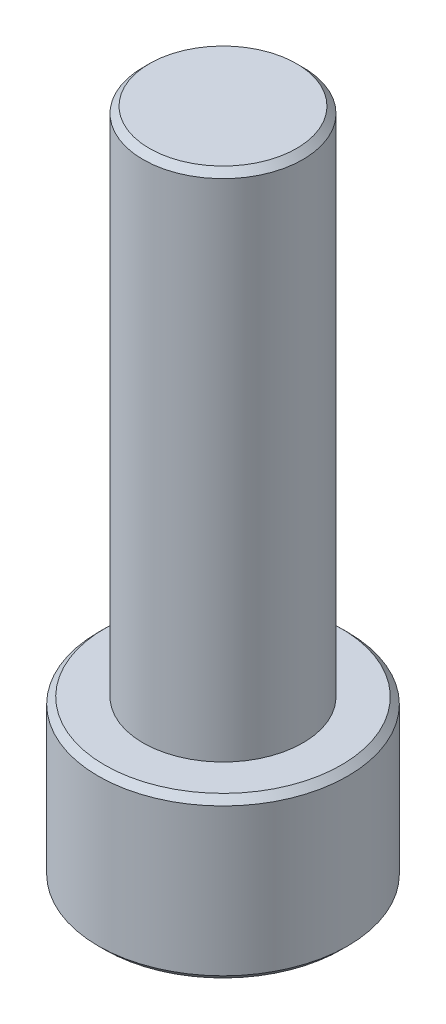
ISO-10303-21;
HEADER;
FILE_DESCRIPTION(('STEP AP214'),'2;1');
FILE_NAME('part.step','',(''),(''),'','','');
FILE_SCHEMA(('AUTOMOTIVE_DESIGN { 1 0 10303 214 1 1 1 1 }'));
ENDSEC;
DATA;
#1=APPLICATION_CONTEXT('core data for automotive mechanical design processes');
#2=APPLICATION_PROTOCOL_DEFINITION('international standard','automotive_design',2000,#1);
#3=PRODUCT_CONTEXT('',#1,'mechanical');
#4=PRODUCT('Part','Part','',(#3));
#5=PRODUCT_RELATED_PRODUCT_CATEGORY('part','',(#4));
#6=PRODUCT_DEFINITION_FORMATION('','',#4);
#7=PRODUCT_DEFINITION_CONTEXT('part definition',#1,'design');
#8=PRODUCT_DEFINITION('design','',#6,#7);
#9=PRODUCT_DEFINITION_SHAPE('','',#8);
#10=(LENGTH_UNIT() NAMED_UNIT(*) SI_UNIT(.MILLI.,.METRE.));
#11=(NAMED_UNIT(*) PLANE_ANGLE_UNIT() SI_UNIT($,.RADIAN.));
#12=(NAMED_UNIT(*) SI_UNIT($,.STERADIAN.) SOLID_ANGLE_UNIT());
#13=UNCERTAINTY_MEASURE_WITH_UNIT(LENGTH_MEASURE(1.E-05),#10,'distance_accuracy_value','');
#14=(GEOMETRIC_REPRESENTATION_CONTEXT(3) GLOBAL_UNCERTAINTY_ASSIGNED_CONTEXT((#13)) GLOBAL_UNIT_ASSIGNED_CONTEXT((#10,
#11,#12)) REPRESENTATION_CONTEXT('',''));
#15=CARTESIAN_POINT('',(0.,0.,0.));
#16=DIRECTION('',(0.,0.,1.));
#17=DIRECTION('',(1.,0.,0.));
#18=AXIS2_PLACEMENT_3D('',#15,#16,#17);
#19=CARTESIAN_POINT('',(0.,0.,0.));
#20=DIRECTION('',(0.,1.,0.));
#21=DIRECTION('',(0.,0.,1.));
#22=AXIS2_PLACEMENT_3D('',#19,#20,#21);
#23=PLANE('',#22);
#24=CARTESIAN_POINT('',(0.,0.,0.));
#25=DIRECTION('',(0.,1.,0.));
#26=DIRECTION('',(0.,0.,1.));
#27=AXIS2_PLACEMENT_3D('',#24,#25,#26);
#28=CIRCLE('',#27,1.85);
#29=CARTESIAN_POINT('',(0.,0.,1.85));
#30=VERTEX_POINT('',#29);
#31=EDGE_CURVE('E152',#30,#30,#28,.T.);
#32=ORIENTED_EDGE('',*,*,#31,.T.);
#33=EDGE_LOOP('',(#32));
#34=FACE_BOUND('',#33,.T.);
#35=CARTESIAN_POINT('',(0.,0.,0.));
#36=DIRECTION('',(0.,1.,0.));
#37=DIRECTION('',(0.,0.,1.));
#38=AXIS2_PLACEMENT_3D('',#35,#36,#37);
#39=CIRCLE('',#38,1.25);
#40=CARTESIAN_POINT('',(0.,0.,1.25));
#41=VERTEX_POINT('',#40);
#42=EDGE_CURVE('E138',#41,#41,#39,.T.);
#43=ORIENTED_EDGE('',*,*,#42,.F.);
#44=EDGE_LOOP('',(#43));
#45=FACE_BOUND('',#44,.T.);
#46=ADVANCED_FACE('F36',(#34,#45),#23,.T.);
#47=CARTESIAN_POINT('',(0.,-2.5,0.));
#48=DIRECTION('',(0.,1.,0.));
#49=DIRECTION('',(0.,0.,1.));
#50=AXIS2_PLACEMENT_3D('',#47,#48,#49);
#51=CYLINDRICAL_SURFACE('',#50,1.95);
#52=CARTESIAN_POINT('',(0.,-0.099999999999999,0.));
#53=DIRECTION('',(0.,1.,0.));
#54=DIRECTION('',(0.,0.,1.));
#55=AXIS2_PLACEMENT_3D('',#52,#53,#54);
#56=CIRCLE('',#55,1.95);
#57=CARTESIAN_POINT('',(0.,-0.099999999999999,1.95));
#58=VERTEX_POINT('',#57);
#59=EDGE_CURVE('E44',#58,#58,#56,.F.);
#60=ORIENTED_EDGE('',*,*,#59,.T.);
#61=EDGE_LOOP('',(#60));
#62=FACE_BOUND('',#61,.T.);
#63=CARTESIAN_POINT('',(0.,-2.4,0.));
#64=DIRECTION('',(0.,1.,0.));
#65=DIRECTION('',(0.,0.,1.));
#66=AXIS2_PLACEMENT_3D('',#63,#64,#65);
#67=CIRCLE('',#66,1.95);
#68=CARTESIAN_POINT('',(0.,-2.4,1.95));
#69=VERTEX_POINT('',#68);
#70=EDGE_CURVE('E155',#69,#69,#67,.T.);
#71=ORIENTED_EDGE('',*,*,#70,.T.);
#72=EDGE_LOOP('',(#71));
#73=FACE_BOUND('',#72,.T.);
#74=ADVANCED_FACE('F160',(#62,#73),#51,.T.);
#75=CARTESIAN_POINT('',(0.,-2.5,0.));
#76=DIRECTION('',(0.,1.,0.));
#77=DIRECTION('',(0.,0.,1.));
#78=AXIS2_PLACEMENT_3D('',#75,#76,#77);
#79=PLANE('',#78);
#80=CARTESIAN_POINT('',(0.,-2.5,0.));
#81=DIRECTION('',(0.,1.,0.));
#82=DIRECTION('',(0.,0.,1.));
#83=AXIS2_PLACEMENT_3D('',#80,#81,#82);
#84=CIRCLE('',#83,1.85);
#85=CARTESIAN_POINT('',(0.,-2.5,1.85));
#86=VERTEX_POINT('',#85);
#87=EDGE_CURVE('E11',#86,#86,#84,.F.);
#88=ORIENTED_EDGE('',*,*,#87,.T.);
#89=EDGE_LOOP('',(#88));
#90=FACE_BOUND('',#89,.T.);
#91=DIRECTION('',(0.866025403784439,0.,0.5));
#92=VECTOR('',#91,1.);
#93=CARTESIAN_POINT('',(-0.999999999999999,-2.5,0.577350269189626));
#94=LINE('',#93,#92);
#95=CARTESIAN_POINT('',(-0.999999999999999,-2.5,0.577350269189626));
#96=VERTEX_POINT('',#95);
#97=CARTESIAN_POINT('',(0.,-2.5,1.15470053837925));
#98=VERTEX_POINT('',#97);
#99=EDGE_CURVE('E113',#96,#98,#94,.T.);
#100=ORIENTED_EDGE('',*,*,#99,.T.);
#101=DIRECTION('',(0.866025403784439,0.,-0.5));
#102=VECTOR('',#101,1.);
#103=CARTESIAN_POINT('',(0.,-2.5,1.15470053837925));
#104=LINE('',#103,#102);
#105=CARTESIAN_POINT('',(0.999999999999999,-2.5,0.577350269189626));
#106=VERTEX_POINT('',#105);
#107=EDGE_CURVE('E136',#98,#106,#104,.T.);
#108=ORIENTED_EDGE('',*,*,#107,.T.);
#109=DIRECTION('',(0.,0.,-1.));
#110=VECTOR('',#109,1.);
#111=CARTESIAN_POINT('',(0.999999999999999,-2.5,0.577350269189626));
#112=LINE('',#111,#110);
#113=CARTESIAN_POINT('',(0.999999999999999,-2.5,-0.577350269189627));
#114=VERTEX_POINT('',#113);
#115=EDGE_CURVE('E118',#106,#114,#112,.T.);
#116=ORIENTED_EDGE('',*,*,#115,.T.);
#117=DIRECTION('',(-0.866025403784439,0.,-0.5));
#118=VECTOR('',#117,1.);
#119=CARTESIAN_POINT('',(0.999999999999999,-2.5,-0.577350269189627));
#120=LINE('',#119,#118);
#121=CARTESIAN_POINT('',(0.,-2.5,-1.15470053837925));
#122=VERTEX_POINT('',#121);
#123=EDGE_CURVE('E51',#114,#122,#120,.T.);
#124=ORIENTED_EDGE('',*,*,#123,.T.);
#125=DIRECTION('',(-0.866025403784439,0.,0.5));
#126=VECTOR('',#125,1.);
#127=CARTESIAN_POINT('',(0.,-2.5,-1.15470053837925));
#128=LINE('',#127,#126);
#129=CARTESIAN_POINT('',(-1.,-2.5,-0.577350269189626));
#130=VERTEX_POINT('',#129);
#131=EDGE_CURVE('E99',#122,#130,#128,.T.);
#132=ORIENTED_EDGE('',*,*,#131,.T.);
#133=DIRECTION('',(0.,0.,1.));
#134=VECTOR('',#133,1.);
#135=CARTESIAN_POINT('',(-1.,-2.5,-0.577350269189626));
#136=LINE('',#135,#134);
#137=EDGE_CURVE('E109',#130,#96,#136,.T.);
#138=ORIENTED_EDGE('',*,*,#137,.T.);
#139=EDGE_LOOP('',(#100,#108,#116,#124,#132,#138));
#140=FACE_BOUND('',#139,.T.);
#141=ADVANCED_FACE('F115',(#90,#140),#79,.F.);
#142=CARTESIAN_POINT('',(0.,8.,0.));
#143=DIRECTION('',(0.,-1.,0.));
#144=DIRECTION('',(0.,0.,-1.));
#145=AXIS2_PLACEMENT_3D('',#142,#143,#144);
#146=CYLINDRICAL_SURFACE('',#145,1.25);
#147=CARTESIAN_POINT('',(0.,7.9,0.));
#148=DIRECTION('',(0.,1.,0.));
#149=DIRECTION('',(0.,0.,1.));
#150=AXIS2_PLACEMENT_3D('',#147,#148,#149);
#151=CIRCLE('',#150,1.25);
#152=CARTESIAN_POINT('',(0.,7.9,1.25));
#153=VERTEX_POINT('',#152);
#154=EDGE_CURVE('E149',#153,#153,#151,.F.);
#155=ORIENTED_EDGE('',*,*,#154,.T.);
#156=EDGE_LOOP('',(#155));
#157=FACE_BOUND('',#156,.T.);
#158=ORIENTED_EDGE('',*,*,#42,.T.);
#159=EDGE_LOOP('',(#158));
#160=FACE_BOUND('',#159,.T.);
#161=ADVANCED_FACE('F174',(#157,#160),#146,.T.);
#162=CARTESIAN_POINT('',(0.,8.,0.));
#163=DIRECTION('',(0.,1.,0.));
#164=DIRECTION('',(0.,0.,1.));
#165=AXIS2_PLACEMENT_3D('',#162,#163,#164);
#166=PLANE('',#165);
#167=CARTESIAN_POINT('',(0.,8.,0.));
#168=DIRECTION('',(0.,1.,0.));
#169=DIRECTION('',(0.,0.,1.));
#170=AXIS2_PLACEMENT_3D('',#167,#168,#169);
#171=CIRCLE('',#170,1.15);
#172=CARTESIAN_POINT('',(0.,8.,1.15));
#173=VERTEX_POINT('',#172);
#174=EDGE_CURVE('E146',#173,#173,#171,.T.);
#175=ORIENTED_EDGE('',*,*,#174,.T.);
#176=EDGE_LOOP('',(#175));
#177=FACE_BOUND('',#176,.T.);
#178=ADVANCED_FACE('F176',(#177),#166,.T.);
#179=CARTESIAN_POINT('',(0.,-2.5,1.15470053837925));
#180=DIRECTION('',(0.5,0.,0.866025403784439));
#181=DIRECTION('',(0.866025403784439,0.,-0.5));
#182=AXIS2_PLACEMENT_3D('',#179,#180,#181);
#183=PLANE('',#182);
#184=DIRECTION('',(0.866025403784439,0.,-0.5));
#185=VECTOR('',#184,1.);
#186=CARTESIAN_POINT('',(0.,-1.25,1.15470053837925));
#187=LINE('',#186,#185);
#188=CARTESIAN_POINT('',(0.,-1.25,1.15470053837925));
#189=VERTEX_POINT('',#188);
#190=CARTESIAN_POINT('',(0.999999999999999,-1.25,0.577350269189626));
#191=VERTEX_POINT('',#190);
#192=EDGE_CURVE('E123',#189,#191,#187,.T.);
#193=ORIENTED_EDGE('',*,*,#192,.T.);
#194=DIRECTION('',(0.,1.,0.));
#195=VECTOR('',#194,1.);
#196=CARTESIAN_POINT('',(0.999999999999999,-2.5,0.577350269189626));
#197=LINE('',#196,#195);
#198=EDGE_CURVE('E88',#106,#191,#197,.T.);
#199=ORIENTED_EDGE('',*,*,#198,.F.);
#200=ORIENTED_EDGE('',*,*,#107,.F.);
#201=DIRECTION('',(0.,1.,0.));
#202=VECTOR('',#201,1.);
#203=CARTESIAN_POINT('',(0.,-2.5,1.15470053837925));
#204=LINE('',#203,#202);
#205=EDGE_CURVE('E60',#98,#189,#204,.T.);
#206=ORIENTED_EDGE('',*,*,#205,.T.);
#207=EDGE_LOOP('',(#193,#199,#200,#206));
#208=FACE_BOUND('',#207,.T.);
#209=ADVANCED_FACE('F183',(#208),#183,.F.);
#210=CARTESIAN_POINT('',(-0.999999999999999,-2.5,0.577350269189626));
#211=DIRECTION('',(-0.5,0.,0.866025403784439));
#212=DIRECTION('',(0.866025403784439,0.,0.5));
#213=AXIS2_PLACEMENT_3D('',#210,#211,#212);
#214=PLANE('',#213);
#215=DIRECTION('',(0.866025403784439,0.,0.5));
#216=VECTOR('',#215,1.);
#217=CARTESIAN_POINT('',(-0.999999999999999,-1.25,0.577350269189626));
#218=LINE('',#217,#216);
#219=CARTESIAN_POINT('',(-0.999999999999999,-1.25,0.577350269189626));
#220=VERTEX_POINT('',#219);
#221=EDGE_CURVE('E134',#220,#189,#218,.T.);
#222=ORIENTED_EDGE('',*,*,#221,.T.);
#223=ORIENTED_EDGE('',*,*,#205,.F.);
#224=ORIENTED_EDGE('',*,*,#99,.F.);
#225=DIRECTION('',(0.,1.,0.));
#226=VECTOR('',#225,1.);
#227=CARTESIAN_POINT('',(-0.999999999999999,-2.5,0.577350269189626));
#228=LINE('',#227,#226);
#229=EDGE_CURVE('E105',#96,#220,#228,.T.);
#230=ORIENTED_EDGE('',*,*,#229,.T.);
#231=EDGE_LOOP('',(#222,#223,#224,#230));
#232=FACE_BOUND('',#231,.T.);
#233=ADVANCED_FACE('F211',(#232),#214,.F.);
#234=CARTESIAN_POINT('',(-1.,-2.5,-0.577350269189626));
#235=DIRECTION('',(-1.,0.,0.));
#236=DIRECTION('',(0.,0.,1.));
#237=AXIS2_PLACEMENT_3D('',#234,#235,#236);
#238=PLANE('',#237);
#239=DIRECTION('',(0.,0.,1.));
#240=VECTOR('',#239,1.);
#241=CARTESIAN_POINT('',(-1.,-1.25,-0.577350269189626));
#242=LINE('',#241,#240);
#243=CARTESIAN_POINT('',(-1.,-1.25,-0.577350269189626));
#244=VERTEX_POINT('',#243);
#245=EDGE_CURVE('E132',#244,#220,#242,.T.);
#246=ORIENTED_EDGE('',*,*,#245,.T.);
#247=ORIENTED_EDGE('',*,*,#229,.F.);
#248=ORIENTED_EDGE('',*,*,#137,.F.);
#249=DIRECTION('',(0.,1.,0.));
#250=VECTOR('',#249,1.);
#251=CARTESIAN_POINT('',(-1.,-2.5,-0.577350269189626));
#252=LINE('',#251,#250);
#253=EDGE_CURVE('E95',#130,#244,#252,.T.);
#254=ORIENTED_EDGE('',*,*,#253,.T.);
#255=EDGE_LOOP('',(#246,#247,#248,#254));
#256=FACE_BOUND('',#255,.T.);
#257=ADVANCED_FACE('F110',(#256),#238,.F.);
#258=CARTESIAN_POINT('',(0.,-2.5,-1.15470053837925));
#259=DIRECTION('',(-0.5,0.,-0.866025403784438));
#260=DIRECTION('',(-0.866025403784438,0.,0.5));
#261=AXIS2_PLACEMENT_3D('',#258,#259,#260);
#262=PLANE('',#261);
#263=DIRECTION('',(-0.866025403784439,0.,0.5));
#264=VECTOR('',#263,1.);
#265=CARTESIAN_POINT('',(0.,-1.25,-1.15470053837925));
#266=LINE('',#265,#264);
#267=CARTESIAN_POINT('',(0.,-1.25,-1.15470053837925));
#268=VERTEX_POINT('',#267);
#269=EDGE_CURVE('E101',#268,#244,#266,.T.);
#270=ORIENTED_EDGE('',*,*,#269,.T.);
#271=ORIENTED_EDGE('',*,*,#253,.F.);
#272=ORIENTED_EDGE('',*,*,#131,.F.);
#273=DIRECTION('',(0.,1.,0.));
#274=VECTOR('',#273,1.);
#275=CARTESIAN_POINT('',(0.,-2.5,-1.15470053837925));
#276=LINE('',#275,#274);
#277=EDGE_CURVE('E106',#122,#268,#276,.T.);
#278=ORIENTED_EDGE('',*,*,#277,.T.);
#279=EDGE_LOOP('',(#270,#271,#272,#278));
#280=FACE_BOUND('',#279,.T.);
#281=ADVANCED_FACE('F97',(#280),#262,.F.);
#282=CARTESIAN_POINT('',(0.999999999999999,-2.5,-0.577350269189627));
#283=DIRECTION('',(0.5,0.,-0.866025403784439));
#284=DIRECTION('',(-0.866025403784439,0.,-0.5));
#285=AXIS2_PLACEMENT_3D('',#282,#283,#284);
#286=PLANE('',#285);
#287=DIRECTION('',(-0.866025403784439,0.,-0.5));
#288=VECTOR('',#287,1.);
#289=CARTESIAN_POINT('',(0.999999999999999,-1.25,-0.577350269189627));
#290=LINE('',#289,#288);
#291=CARTESIAN_POINT('',(0.999999999999999,-1.25,-0.577350269189627));
#292=VERTEX_POINT('',#291);
#293=EDGE_CURVE('E128',#292,#268,#290,.T.);
#294=ORIENTED_EDGE('',*,*,#293,.T.);
#295=ORIENTED_EDGE('',*,*,#277,.F.);
#296=ORIENTED_EDGE('',*,*,#123,.F.);
#297=DIRECTION('',(0.,1.,0.));
#298=VECTOR('',#297,1.);
#299=CARTESIAN_POINT('',(0.999999999999999,-2.5,-0.577350269189627));
#300=LINE('',#299,#298);
#301=EDGE_CURVE('E141',#114,#292,#300,.T.);
#302=ORIENTED_EDGE('',*,*,#301,.T.);
#303=EDGE_LOOP('',(#294,#295,#296,#302));
#304=FACE_BOUND('',#303,.T.);
#305=ADVANCED_FACE('F207',(#304),#286,.F.);
#306=CARTESIAN_POINT('',(0.999999999999999,-2.5,0.577350269189626));
#307=DIRECTION('',(1.,0.,0.));
#308=DIRECTION('',(0.,0.,-1.));
#309=AXIS2_PLACEMENT_3D('',#306,#307,#308);
#310=PLANE('',#309);
#311=DIRECTION('',(0.,0.,-1.));
#312=VECTOR('',#311,1.);
#313=CARTESIAN_POINT('',(0.999999999999999,-1.25,0.577350269189626));
#314=LINE('',#313,#312);
#315=EDGE_CURVE('E125',#191,#292,#314,.T.);
#316=ORIENTED_EDGE('',*,*,#315,.T.);
#317=ORIENTED_EDGE('',*,*,#301,.F.);
#318=ORIENTED_EDGE('',*,*,#115,.F.);
#319=ORIENTED_EDGE('',*,*,#198,.T.);
#320=EDGE_LOOP('',(#316,#317,#318,#319));
#321=FACE_BOUND('',#320,.T.);
#322=ADVANCED_FACE('F198',(#321),#310,.F.);
#323=CARTESIAN_POINT('',(0.,-1.25,0.));
#324=DIRECTION('',(0.,1.,0.));
#325=DIRECTION('',(0.,0.,1.));
#326=AXIS2_PLACEMENT_3D('',#323,#324,#325);
#327=PLANE('',#326);
#328=ORIENTED_EDGE('',*,*,#192,.F.);
#329=ORIENTED_EDGE('',*,*,#221,.F.);
#330=ORIENTED_EDGE('',*,*,#245,.F.);
#331=ORIENTED_EDGE('',*,*,#269,.F.);
#332=ORIENTED_EDGE('',*,*,#293,.F.);
#333=ORIENTED_EDGE('',*,*,#315,.F.);
#334=EDGE_LOOP('',(#328,#329,#330,#331,#332,#333));
#335=FACE_BOUND('',#334,.T.);
#336=ADVANCED_FACE('F193',(#335),#327,.F.);
#337=CARTESIAN_POINT('',(0.,8.,0.));
#338=DIRECTION('',(0.,-1.,0.));
#339=DIRECTION('',(0.,0.,-1.));
#340=AXIS2_PLACEMENT_3D('',#337,#338,#339);
#341=CONICAL_SURFACE('',#340,1.15,0.785398163397443);
#342=ORIENTED_EDGE('',*,*,#154,.F.);
#343=EDGE_LOOP('',(#342));
#344=FACE_BOUND('',#343,.T.);
#345=ORIENTED_EDGE('',*,*,#174,.F.);
#346=EDGE_LOOP('',(#345));
#347=FACE_BOUND('',#346,.T.);
#348=ADVANCED_FACE('F166',(#344,#347),#341,.T.);
#349=CARTESIAN_POINT('',(0.,0.,0.));
#350=DIRECTION('',(0.,-1.,0.));
#351=DIRECTION('',(0.,0.,-1.));
#352=AXIS2_PLACEMENT_3D('',#349,#350,#351);
#353=CONICAL_SURFACE('',#352,1.85,0.785398163397447);
#354=ORIENTED_EDGE('',*,*,#59,.F.);
#355=EDGE_LOOP('',(#354));
#356=FACE_BOUND('',#355,.T.);
#357=ORIENTED_EDGE('',*,*,#31,.F.);
#358=EDGE_LOOP('',(#357));
#359=FACE_BOUND('',#358,.T.);
#360=ADVANCED_FACE('F163',(#356,#359),#353,.T.);
#361=CARTESIAN_POINT('',(0.,-2.4,0.));
#362=DIRECTION('',(0.,1.,0.));
#363=DIRECTION('',(0.,0.,1.));
#364=AXIS2_PLACEMENT_3D('',#361,#362,#363);
#365=CONICAL_SURFACE('',#364,1.95,0.785398163397449);
#366=ORIENTED_EDGE('',*,*,#87,.F.);
#367=EDGE_LOOP('',(#366));
#368=FACE_BOUND('',#367,.T.);
#369=ORIENTED_EDGE('',*,*,#70,.F.);
#370=EDGE_LOOP('',(#369));
#371=FACE_BOUND('',#370,.T.);
#372=ADVANCED_FACE('F38',(#368,#371),#365,.T.);
#373=CLOSED_SHELL('',(#46,#74,#141,#161,#178,#209,#233,#257,#281,#305,#322,#336,#348,#360,#372));
#374=MANIFOLD_SOLID_BREP('B2',#373);
#375=ADVANCED_BREP_SHAPE_REPRESENTATION('',(#18,#374),#14);
#376=SHAPE_DEFINITION_REPRESENTATION(#9,#375);
ENDSEC;
END-ISO-10303-21;
